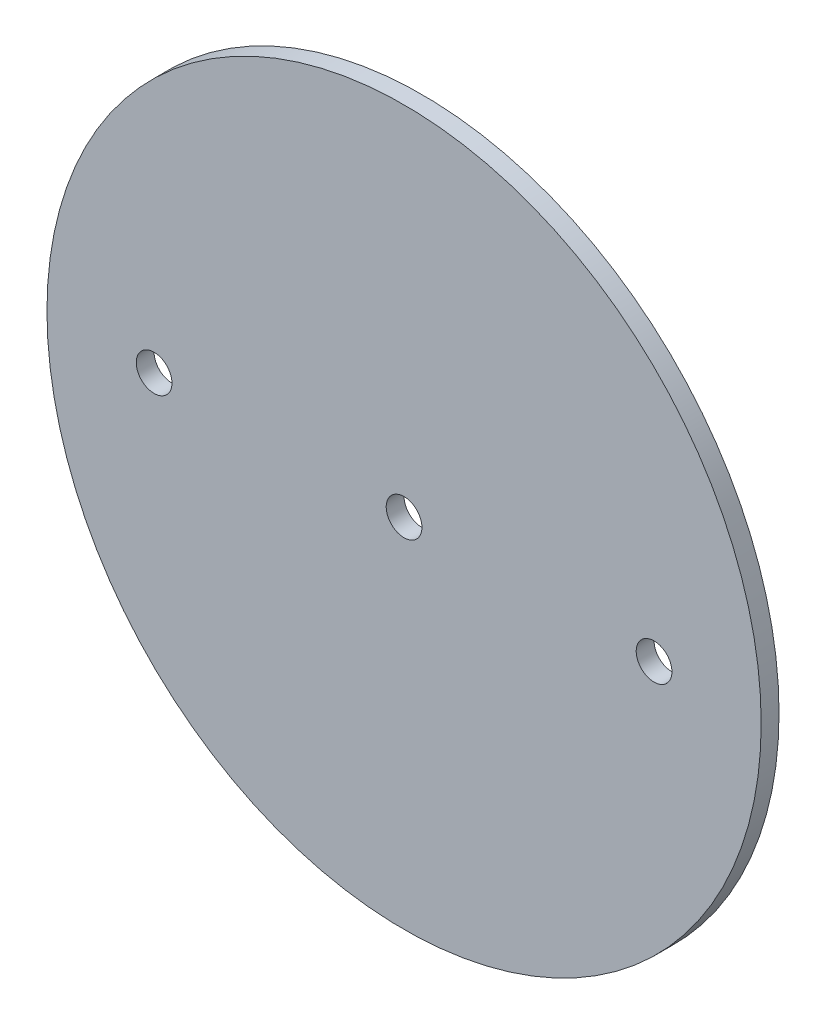
ISO-10303-21;
HEADER;
FILE_DESCRIPTION(('STEP AP214'),'2;1');
FILE_NAME('part.step','',(''),(''),'','','');
FILE_SCHEMA(('AUTOMOTIVE_DESIGN { 1 0 10303 214 1 1 1 1 }'));
ENDSEC;
DATA;
#1=APPLICATION_CONTEXT('core data for automotive mechanical design processes');
#2=APPLICATION_PROTOCOL_DEFINITION('international standard','automotive_design',2000,#1);
#3=PRODUCT_CONTEXT('',#1,'mechanical');
#4=PRODUCT('Part','Part','',(#3));
#5=PRODUCT_RELATED_PRODUCT_CATEGORY('part','',(#4));
#6=PRODUCT_DEFINITION_FORMATION('','',#4);
#7=PRODUCT_DEFINITION_CONTEXT('part definition',#1,'design');
#8=PRODUCT_DEFINITION('design','',#6,#7);
#9=PRODUCT_DEFINITION_SHAPE('','',#8);
#10=(LENGTH_UNIT() NAMED_UNIT(*) SI_UNIT(.MILLI.,.METRE.));
#11=(NAMED_UNIT(*) PLANE_ANGLE_UNIT() SI_UNIT($,.RADIAN.));
#12=(NAMED_UNIT(*) SI_UNIT($,.STERADIAN.) SOLID_ANGLE_UNIT());
#13=UNCERTAINTY_MEASURE_WITH_UNIT(LENGTH_MEASURE(1.E-05),#10,'distance_accuracy_value','');
#14=(GEOMETRIC_REPRESENTATION_CONTEXT(3) GLOBAL_UNCERTAINTY_ASSIGNED_CONTEXT((#13)) GLOBAL_UNIT_ASSIGNED_CONTEXT((#10,
#11,#12)) REPRESENTATION_CONTEXT('',''));
#15=CARTESIAN_POINT('',(0.,0.,0.));
#16=DIRECTION('',(0.,0.,1.));
#17=DIRECTION('',(1.,0.,0.));
#18=AXIS2_PLACEMENT_3D('',#15,#16,#17);
#19=CARTESIAN_POINT('',(0.,0.,1.58750000000007));
#20=DIRECTION('',(0.,0.,-0.999999999999998));
#21=DIRECTION('',(-1.,0.,0.));
#22=AXIS2_PLACEMENT_3D('',#19,#20,#21);
#23=CYLINDRICAL_SURFACE('',#22,63.5);
#24=CARTESIAN_POINT('',(0.,0.,1.58750000000007));
#25=DIRECTION('',(0.,0.,0.999999999999998));
#26=DIRECTION('',(1.,0.,0.));
#27=AXIS2_PLACEMENT_3D('',#24,#25,#26);
#28=CIRCLE('',#27,63.5);
#29=CARTESIAN_POINT('',(63.5,0.,1.58750000000007));
#30=VERTEX_POINT('',#29);
#31=EDGE_CURVE('E10',#30,#30,#28,.T.);
#32=ORIENTED_EDGE('',*,*,#31,.F.);
#33=EDGE_LOOP('',(#32));
#34=FACE_BOUND('',#33,.T.);
#35=CARTESIAN_POINT('',(0.,0.,-1.58750000000007));
#36=DIRECTION('',(0.,0.,0.999999999999998));
#37=DIRECTION('',(1.,0.,0.));
#38=AXIS2_PLACEMENT_3D('',#35,#36,#37);
#39=CIRCLE('',#38,63.5);
#40=CARTESIAN_POINT('',(63.5,0.,-1.58750000000007));
#41=VERTEX_POINT('',#40);
#42=EDGE_CURVE('E42',#41,#41,#39,.T.);
#43=ORIENTED_EDGE('',*,*,#42,.T.);
#44=EDGE_LOOP('',(#43));
#45=FACE_BOUND('',#44,.T.);
#46=ADVANCED_FACE('F39',(#34,#45),#23,.T.);
#47=CARTESIAN_POINT('',(0.,0.,1.58750000000007));
#48=DIRECTION('',(0.,0.,0.999999999999998));
#49=DIRECTION('',(1.,0.,0.));
#50=AXIS2_PLACEMENT_3D('',#47,#48,#49);
#51=PLANE('',#50);
#52=CARTESIAN_POINT('',(0.,0.,1.58750000000007));
#53=DIRECTION('',(0.,0.,0.999999999999998));
#54=DIRECTION('',(1.,0.,0.));
#55=AXIS2_PLACEMENT_3D('',#52,#53,#54);
#56=CIRCLE('',#55,3.17499999999999);
#57=CARTESIAN_POINT('',(3.17499999999999,0.,1.58750000000007));
#58=VERTEX_POINT('',#57);
#59=EDGE_CURVE('E73',#58,#58,#56,.T.);
#60=ORIENTED_EDGE('',*,*,#59,.F.);
#61=EDGE_LOOP('',(#60));
#62=FACE_BOUND('',#61,.T.);
#63=CARTESIAN_POINT('',(44.4500000000004,0.,1.58750000000007));
#64=DIRECTION('',(0.,0.,0.999999999999998));
#65=DIRECTION('',(1.,0.,0.));
#66=AXIS2_PLACEMENT_3D('',#63,#64,#65);
#67=CIRCLE('',#66,3.17499999999998);
#68=CARTESIAN_POINT('',(47.6250000000004,0.,1.58750000000007));
#69=VERTEX_POINT('',#68);
#70=EDGE_CURVE('E65',#69,#69,#67,.T.);
#71=ORIENTED_EDGE('',*,*,#70,.F.);
#72=EDGE_LOOP('',(#71));
#73=FACE_BOUND('',#72,.T.);
#74=CARTESIAN_POINT('',(-44.4500000000001,6.66133814775094E-13,1.58750000000007));
#75=DIRECTION('',(0.,0.,0.999999999999998));
#76=DIRECTION('',(1.,0.,0.));
#77=AXIS2_PLACEMENT_3D('',#74,#75,#76);
#78=CIRCLE('',#77,3.17499999999999);
#79=CARTESIAN_POINT('',(-41.2750000000001,6.66133814775094E-13,1.58750000000007));
#80=VERTEX_POINT('',#79);
#81=EDGE_CURVE('E57',#80,#80,#78,.T.);
#82=ORIENTED_EDGE('',*,*,#81,.F.);
#83=EDGE_LOOP('',(#82));
#84=FACE_BOUND('',#83,.T.);
#85=ORIENTED_EDGE('',*,*,#31,.T.);
#86=EDGE_LOOP('',(#85));
#87=FACE_BOUND('',#86,.T.);
#88=ADVANCED_FACE('F81',(#62,#73,#84,#87),#51,.T.);
#89=CARTESIAN_POINT('',(0.,0.,-1.58750000000007));
#90=DIRECTION('',(0.,0.,0.999999999999998));
#91=DIRECTION('',(1.,0.,0.));
#92=AXIS2_PLACEMENT_3D('',#89,#90,#91);
#93=PLANE('',#92);
#94=CARTESIAN_POINT('',(0.,0.,-1.58750000000007));
#95=DIRECTION('',(0.,0.,0.999999999999998));
#96=DIRECTION('',(1.,0.,0.));
#97=AXIS2_PLACEMENT_3D('',#94,#95,#96);
#98=CIRCLE('',#97,3.17499999999999);
#99=CARTESIAN_POINT('',(3.17499999999999,0.,-1.58750000000007));
#100=VERTEX_POINT('',#99);
#101=EDGE_CURVE('E69',#100,#100,#98,.T.);
#102=ORIENTED_EDGE('',*,*,#101,.T.);
#103=EDGE_LOOP('',(#102));
#104=FACE_BOUND('',#103,.T.);
#105=CARTESIAN_POINT('',(44.4500000000004,0.,-1.58750000000007));
#106=DIRECTION('',(0.,0.,0.999999999999998));
#107=DIRECTION('',(1.,0.,0.));
#108=AXIS2_PLACEMENT_3D('',#105,#106,#107);
#109=CIRCLE('',#108,3.17499999999999);
#110=CARTESIAN_POINT('',(47.6250000000004,0.,-1.58750000000007));
#111=VERTEX_POINT('',#110);
#112=EDGE_CURVE('E61',#111,#111,#109,.T.);
#113=ORIENTED_EDGE('',*,*,#112,.T.);
#114=EDGE_LOOP('',(#113));
#115=FACE_BOUND('',#114,.T.);
#116=CARTESIAN_POINT('',(-44.4500000000001,6.66133814775094E-13,-1.58750000000007));
#117=DIRECTION('',(0.,0.,0.999999999999998));
#118=DIRECTION('',(1.,0.,0.));
#119=AXIS2_PLACEMENT_3D('',#116,#117,#118);
#120=CIRCLE('',#119,3.17499999999999);
#121=CARTESIAN_POINT('',(-41.2750000000001,6.66133814775094E-13,-1.58750000000007));
#122=VERTEX_POINT('',#121);
#123=EDGE_CURVE('E52',#122,#122,#120,.T.);
#124=ORIENTED_EDGE('',*,*,#123,.T.);
#125=EDGE_LOOP('',(#124));
#126=FACE_BOUND('',#125,.T.);
#127=ORIENTED_EDGE('',*,*,#42,.F.);
#128=EDGE_LOOP('',(#127));
#129=FACE_BOUND('',#128,.T.);
#130=ADVANCED_FACE('F84',(#104,#115,#126,#129),#93,.F.);
#131=CARTESIAN_POINT('',(-44.4500000000001,6.66133814775094E-13,1.58750000000007));
#132=DIRECTION('',(0.,0.,0.999999999999998));
#133=DIRECTION('',(1.,0.,0.));
#134=AXIS2_PLACEMENT_3D('',#131,#132,#133);
#135=CYLINDRICAL_SURFACE('',#134,3.17499999999999);
#136=ORIENTED_EDGE('',*,*,#123,.F.);
#137=EDGE_LOOP('',(#136));
#138=FACE_BOUND('',#137,.T.);
#139=ORIENTED_EDGE('',*,*,#81,.T.);
#140=EDGE_LOOP('',(#139));
#141=FACE_BOUND('',#140,.T.);
#142=ADVANCED_FACE('F90',(#138,#141),#135,.F.);
#143=CARTESIAN_POINT('',(44.4500000000004,0.,1.58750000000007));
#144=DIRECTION('',(0.,0.,0.999999999999998));
#145=DIRECTION('',(1.,0.,0.));
#146=AXIS2_PLACEMENT_3D('',#143,#144,#145);
#147=CYLINDRICAL_SURFACE('',#146,3.17499999999999);
#148=ORIENTED_EDGE('',*,*,#112,.F.);
#149=EDGE_LOOP('',(#148));
#150=FACE_BOUND('',#149,.T.);
#151=ORIENTED_EDGE('',*,*,#70,.T.);
#152=EDGE_LOOP('',(#151));
#153=FACE_BOUND('',#152,.T.);
#154=ADVANCED_FACE('F92',(#150,#153),#147,.F.);
#155=CARTESIAN_POINT('',(0.,0.,1.58750000000007));
#156=DIRECTION('',(0.,0.,0.999999999999998));
#157=DIRECTION('',(1.,0.,0.));
#158=AXIS2_PLACEMENT_3D('',#155,#156,#157);
#159=CYLINDRICAL_SURFACE('',#158,3.17499999999999);
#160=ORIENTED_EDGE('',*,*,#101,.F.);
#161=EDGE_LOOP('',(#160));
#162=FACE_BOUND('',#161,.T.);
#163=ORIENTED_EDGE('',*,*,#59,.T.);
#164=EDGE_LOOP('',(#163));
#165=FACE_BOUND('',#164,.T.);
#166=ADVANCED_FACE('F79',(#162,#165),#159,.F.);
#167=CLOSED_SHELL('',(#46,#88,#130,#142,#154,#166));
#168=MANIFOLD_SOLID_BREP('B2',#167);
#169=ADVANCED_BREP_SHAPE_REPRESENTATION('',(#18,#168),#14);
#170=SHAPE_DEFINITION_REPRESENTATION(#9,#169);
ENDSEC;
END-ISO-10303-21;
